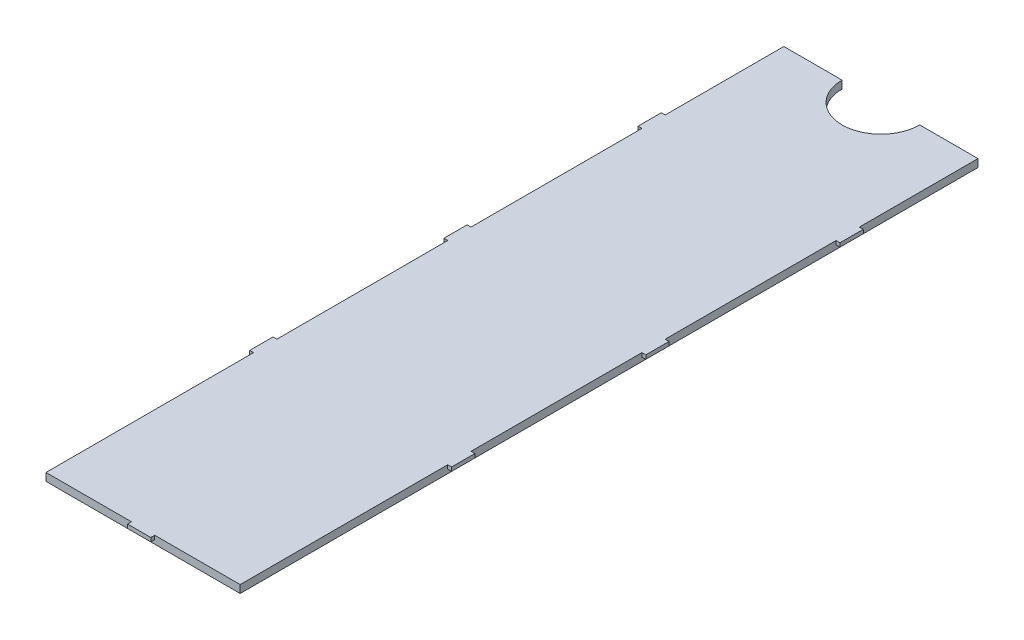
ISO-10303-21;
HEADER;
FILE_DESCRIPTION(('STEP AP214'),'2;1');
FILE_NAME('part.step','',(''),(''),'','','');
FILE_SCHEMA(('AUTOMOTIVE_DESIGN { 1 0 10303 214 1 1 1 1 }'));
ENDSEC;
DATA;
#1=APPLICATION_CONTEXT('core data for automotive mechanical design processes');
#2=APPLICATION_PROTOCOL_DEFINITION('international standard','automotive_design',2000,#1);
#3=PRODUCT_CONTEXT('',#1,'mechanical');
#4=PRODUCT('Part','Part','',(#3));
#5=PRODUCT_RELATED_PRODUCT_CATEGORY('part','',(#4));
#6=PRODUCT_DEFINITION_FORMATION('','',#4);
#7=PRODUCT_DEFINITION_CONTEXT('part definition',#1,'design');
#8=PRODUCT_DEFINITION('design','',#6,#7);
#9=PRODUCT_DEFINITION_SHAPE('','',#8);
#10=(LENGTH_UNIT() NAMED_UNIT(*) SI_UNIT(.MILLI.,.METRE.));
#11=(NAMED_UNIT(*) PLANE_ANGLE_UNIT() SI_UNIT($,.RADIAN.));
#12=(NAMED_UNIT(*) SI_UNIT($,.STERADIAN.) SOLID_ANGLE_UNIT());
#13=UNCERTAINTY_MEASURE_WITH_UNIT(LENGTH_MEASURE(1.E-05),#10,'distance_accuracy_value','');
#14=(GEOMETRIC_REPRESENTATION_CONTEXT(3) GLOBAL_UNCERTAINTY_ASSIGNED_CONTEXT((#13)) GLOBAL_UNIT_ASSIGNED_CONTEXT((#10,
#11,#12)) REPRESENTATION_CONTEXT('',''));
#15=CARTESIAN_POINT('',(0.,0.,0.));
#16=DIRECTION('',(0.,0.,1.));
#17=DIRECTION('',(1.,0.,0.));
#18=AXIS2_PLACEMENT_3D('',#15,#16,#17);
#19=CARTESIAN_POINT('',(0.,35.274050100301,1.80750317688863));
#20=DIRECTION('',(0.,0.,1.));
#21=DIRECTION('',(1.,0.,0.));
#22=AXIS2_PLACEMENT_3D('',#19,#20,#21);
#23=PLANE('',#22);
#24=DIRECTION('',(-1.,0.,0.));
#25=VECTOR('',#24,1.);
#26=CARTESIAN_POINT('',(0.,35.274050100301,1.80750317688863));
#27=LINE('',#26,#25);
#28=CARTESIAN_POINT('',(-86.6012572167533,35.274050100301,1.80750317688863));
#29=VERTEX_POINT('',#28);
#30=CARTESIAN_POINT('',(-94.1012572167536,35.274050100301,1.80750317688863));
#31=VERTEX_POINT('',#30);
#32=EDGE_CURVE('E283',#29,#31,#27,.T.);
#33=ORIENTED_EDGE('',*,*,#32,.F.);
#34=DIRECTION('',(0.,-1.,0.));
#35=VECTOR('',#34,1.);
#36=CARTESIAN_POINT('',(-86.6012572167533,35.274050100301,1.80750317688863));
#37=LINE('',#36,#35);
#38=CARTESIAN_POINT('',(-86.6012572167533,34.274050100301,1.80750317688863));
#39=VERTEX_POINT('',#38);
#40=EDGE_CURVE('E263',#29,#39,#37,.T.);
#41=ORIENTED_EDGE('',*,*,#40,.T.);
#42=DIRECTION('',(-1.,0.,0.));
#43=VECTOR('',#42,1.);
#44=CARTESIAN_POINT('',(0.,34.274050100301,1.80750317688863));
#45=LINE('',#44,#43);
#46=CARTESIAN_POINT('',(-94.1012572167536,34.274050100301,1.80750317688863));
#47=VERTEX_POINT('',#46);
#48=EDGE_CURVE('E302',#39,#47,#45,.T.);
#49=ORIENTED_EDGE('',*,*,#48,.T.);
#50=DIRECTION('',(0.,-1.,0.));
#51=VECTOR('',#50,1.);
#52=CARTESIAN_POINT('',(-94.1012572167536,35.274050100301,1.80750317688863));
#53=LINE('',#52,#51);
#54=EDGE_CURVE('E298',#31,#47,#53,.T.);
#55=ORIENTED_EDGE('',*,*,#54,.F.);
#56=EDGE_LOOP('',(#33,#41,#49,#55));
#57=FACE_BOUND('',#56,.T.);
#58=ADVANCED_FACE('F40',(#57),#23,.F.);
#59=CARTESIAN_POINT('',(-94.1012572167536,35.274050100301,0.));
#60=DIRECTION('',(1.,0.,0.));
#61=DIRECTION('',(0.,0.,-1.));
#62=AXIS2_PLACEMENT_3D('',#59,#60,#61);
#63=PLANE('',#62);
#64=DIRECTION('',(0.,0.,-1.));
#65=VECTOR('',#64,1.);
#66=CARTESIAN_POINT('',(-94.1012572167536,34.774050100301,0.));
#67=LINE('',#66,#65);
#68=CARTESIAN_POINT('',(-94.1012572167536,34.774050100301,20.0802620856482));
#69=VERTEX_POINT('',#68);
#70=CARTESIAN_POINT('',(-94.1012572167536,34.774050100301,17.0802620856482));
#71=VERTEX_POINT('',#70);
#72=EDGE_CURVE('E332',#69,#71,#67,.T.);
#73=ORIENTED_EDGE('',*,*,#72,.T.);
#74=DIRECTION('',(0.,1.,0.));
#75=VECTOR('',#74,1.);
#76=CARTESIAN_POINT('',(-94.1012572167536,35.274050100301,17.0802620856482));
#77=LINE('',#76,#75);
#78=CARTESIAN_POINT('',(-94.1012572167536,35.274050100301,17.0802620856482));
#79=VERTEX_POINT('',#78);
#80=EDGE_CURVE('E398',#71,#79,#77,.T.);
#81=ORIENTED_EDGE('',*,*,#80,.T.);
#82=DIRECTION('',(0.,0.,1.));
#83=VECTOR('',#82,1.);
#84=CARTESIAN_POINT('',(-94.1012572167536,35.274050100301,0.));
#85=LINE('',#84,#83);
#86=EDGE_CURVE('E288',#31,#79,#85,.T.);
#87=ORIENTED_EDGE('',*,*,#86,.F.);
#88=ORIENTED_EDGE('',*,*,#54,.T.);
#89=DIRECTION('',(0.,0.,1.));
#90=VECTOR('',#89,1.);
#91=CARTESIAN_POINT('',(-94.1012572167536,34.274050100301,0.));
#92=LINE('',#91,#90);
#93=CARTESIAN_POINT('',(-94.1012572167536,34.274050100301,96.8075031768886));
#94=VERTEX_POINT('',#93);
#95=EDGE_CURVE('E299',#47,#94,#92,.T.);
#96=ORIENTED_EDGE('',*,*,#95,.T.);
#97=DIRECTION('',(0.,-1.,0.));
#98=VECTOR('',#97,1.);
#99=CARTESIAN_POINT('',(-94.1012572167536,35.274050100301,96.8075031768886));
#100=LINE('',#99,#98);
#101=CARTESIAN_POINT('',(-94.1012572167536,35.274050100301,96.8075031768886));
#102=VERTEX_POINT('',#101);
#103=EDGE_CURVE('E310',#102,#94,#100,.T.);
#104=ORIENTED_EDGE('',*,*,#103,.F.);
#105=CARTESIAN_POINT('',(-94.1012572167536,35.274050100301,70.0802620856482));
#106=VERTEX_POINT('',#105);
#107=EDGE_CURVE('E309',#106,#102,#85,.T.);
#108=ORIENTED_EDGE('',*,*,#107,.F.);
#109=DIRECTION('',(0.,-1.,0.));
#110=VECTOR('',#109,1.);
#111=CARTESIAN_POINT('',(-94.1012572167536,35.274050100301,70.0802620856482));
#112=LINE('',#111,#110);
#113=CARTESIAN_POINT('',(-94.1012572167536,34.774050100301,70.0802620856482));
#114=VERTEX_POINT('',#113);
#115=EDGE_CURVE('E441',#106,#114,#112,.T.);
#116=ORIENTED_EDGE('',*,*,#115,.T.);
#117=DIRECTION('',(0.,0.,-1.));
#118=VECTOR('',#117,1.);
#119=CARTESIAN_POINT('',(-94.1012572167536,34.774050100301,0.));
#120=LINE('',#119,#118);
#121=CARTESIAN_POINT('',(-94.1012572167536,34.774050100301,67.0802620856482));
#122=VERTEX_POINT('',#121);
#123=EDGE_CURVE('E326',#114,#122,#120,.T.);
#124=ORIENTED_EDGE('',*,*,#123,.T.);
#125=DIRECTION('',(0.,1.,0.));
#126=VECTOR('',#125,1.);
#127=CARTESIAN_POINT('',(-94.1012572167536,35.274050100301,67.0802620856482));
#128=LINE('',#127,#126);
#129=CARTESIAN_POINT('',(-94.1012572167536,35.274050100301,67.0802620856482));
#130=VERTEX_POINT('',#129);
#131=EDGE_CURVE('E450',#122,#130,#128,.T.);
#132=ORIENTED_EDGE('',*,*,#131,.T.);
#133=CARTESIAN_POINT('',(-94.1012572167536,35.274050100301,45.0802620856482));
#134=VERTEX_POINT('',#133);
#135=EDGE_CURVE('E563',#134,#130,#85,.T.);
#136=ORIENTED_EDGE('',*,*,#135,.F.);
#137=DIRECTION('',(0.,-1.,0.));
#138=VECTOR('',#137,1.);
#139=CARTESIAN_POINT('',(-94.1012572167536,35.274050100301,45.0802620856482));
#140=LINE('',#139,#138);
#141=CARTESIAN_POINT('',(-94.1012572167536,34.774050100301,45.0802620856482));
#142=VERTEX_POINT('',#141);
#143=EDGE_CURVE('E415',#134,#142,#140,.T.);
#144=ORIENTED_EDGE('',*,*,#143,.T.);
#145=DIRECTION('',(0.,0.,-1.));
#146=VECTOR('',#145,1.);
#147=CARTESIAN_POINT('',(-94.1012572167536,34.774050100301,0.));
#148=LINE('',#147,#146);
#149=CARTESIAN_POINT('',(-94.1012572167536,34.774050100301,42.0802620856482));
#150=VERTEX_POINT('',#149);
#151=EDGE_CURVE('E329',#142,#150,#148,.T.);
#152=ORIENTED_EDGE('',*,*,#151,.T.);
#153=DIRECTION('',(0.,1.,0.));
#154=VECTOR('',#153,1.);
#155=CARTESIAN_POINT('',(-94.1012572167536,35.274050100301,42.0802620856482));
#156=LINE('',#155,#154);
#157=CARTESIAN_POINT('',(-94.1012572167536,35.274050100301,42.0802620856482));
#158=VERTEX_POINT('',#157);
#159=EDGE_CURVE('E424',#150,#158,#156,.T.);
#160=ORIENTED_EDGE('',*,*,#159,.T.);
#161=CARTESIAN_POINT('',(-94.1012572167536,35.274050100301,20.0802620856482));
#162=VERTEX_POINT('',#161);
#163=EDGE_CURVE('E562',#162,#158,#85,.T.);
#164=ORIENTED_EDGE('',*,*,#163,.F.);
#165=DIRECTION('',(0.,-1.,0.));
#166=VECTOR('',#165,1.);
#167=CARTESIAN_POINT('',(-94.1012572167536,35.274050100301,20.0802620856482));
#168=LINE('',#167,#166);
#169=EDGE_CURVE('E390',#162,#69,#168,.T.);
#170=ORIENTED_EDGE('',*,*,#169,.T.);
#171=EDGE_LOOP('',(#73,#81,#87,#88,#96,#104,#108,#116,#124,#132,#136,#144,#152,#160,#164,#170));
#172=FACE_BOUND('',#171,.T.);
#173=ADVANCED_FACE('F42',(#172),#63,.F.);
#174=CARTESIAN_POINT('',(0.,35.274050100301,96.8075031768886));
#175=DIRECTION('',(0.,0.,-1.));
#176=DIRECTION('',(-1.,0.,0.));
#177=AXIS2_PLACEMENT_3D('',#174,#175,#176);
#178=PLANE('',#177);
#179=DIRECTION('',(1.,0.,0.));
#180=VECTOR('',#179,1.);
#181=CARTESIAN_POINT('',(0.,35.274050100301,96.8075031768886));
#182=LINE('',#181,#180);
#183=CARTESIAN_POINT('',(-80.1012572167533,35.274050100301,96.8075031768886));
#184=VERTEX_POINT('',#183);
#185=CARTESIAN_POINT('',(-69.1012572167529,35.274050100301,96.8075031768886));
#186=VERTEX_POINT('',#185);
#187=EDGE_CURVE('E293',#184,#186,#182,.T.);
#188=ORIENTED_EDGE('',*,*,#187,.F.);
#189=DIRECTION('',(0.,-1.,0.));
#190=VECTOR('',#189,1.);
#191=CARTESIAN_POINT('',(-80.1012572167533,35.274050100301,96.8075031768886));
#192=LINE('',#191,#190);
#193=CARTESIAN_POINT('',(-80.1012572167533,34.774050100301,96.8075031768886));
#194=VERTEX_POINT('',#193);
#195=EDGE_CURVE('E475',#184,#194,#192,.T.);
#196=ORIENTED_EDGE('',*,*,#195,.T.);
#197=DIRECTION('',(-1.,0.,0.));
#198=VECTOR('',#197,1.);
#199=CARTESIAN_POINT('',(0.,34.774050100301,96.8075031768886));
#200=LINE('',#199,#198);
#201=CARTESIAN_POINT('',(-83.1012572167533,34.774050100301,96.8075031768886));
#202=VERTEX_POINT('',#201);
#203=EDGE_CURVE('E323',#194,#202,#200,.T.);
#204=ORIENTED_EDGE('',*,*,#203,.T.);
#205=DIRECTION('',(0.,1.,0.));
#206=VECTOR('',#205,1.);
#207=CARTESIAN_POINT('',(-83.1012572167533,35.274050100301,96.8075031768886));
#208=LINE('',#207,#206);
#209=CARTESIAN_POINT('',(-83.1012572167533,35.274050100301,96.8075031768886));
#210=VERTEX_POINT('',#209);
#211=EDGE_CURVE('E467',#202,#210,#208,.T.);
#212=ORIENTED_EDGE('',*,*,#211,.T.);
#213=EDGE_CURVE('E295',#102,#210,#182,.T.);
#214=ORIENTED_EDGE('',*,*,#213,.F.);
#215=ORIENTED_EDGE('',*,*,#103,.T.);
#216=DIRECTION('',(1.,0.,0.));
#217=VECTOR('',#216,1.);
#218=CARTESIAN_POINT('',(0.,34.274050100301,96.8075031768886));
#219=LINE('',#218,#217);
#220=CARTESIAN_POINT('',(-69.1012572167529,34.274050100301,96.8075031768886));
#221=VERTEX_POINT('',#220);
#222=EDGE_CURVE('E307',#94,#221,#219,.T.);
#223=ORIENTED_EDGE('',*,*,#222,.T.);
#224=DIRECTION('',(0.,-1.,0.));
#225=VECTOR('',#224,1.);
#226=CARTESIAN_POINT('',(-69.1012572167529,35.274050100301,96.8075031768886));
#227=LINE('',#226,#225);
#228=EDGE_CURVE('E314',#186,#221,#227,.T.);
#229=ORIENTED_EDGE('',*,*,#228,.F.);
#230=EDGE_LOOP('',(#188,#196,#204,#212,#214,#215,#223,#229));
#231=FACE_BOUND('',#230,.T.);
#232=ADVANCED_FACE('F602',(#231),#178,.F.);
#233=CARTESIAN_POINT('',(-69.1012572167529,35.274050100301,0.));
#234=DIRECTION('',(-1.,0.,0.));
#235=DIRECTION('',(0.,0.,1.));
#236=AXIS2_PLACEMENT_3D('',#233,#234,#235);
#237=PLANE('',#236);
#238=DIRECTION('',(0.,0.,-1.));
#239=VECTOR('',#238,1.);
#240=CARTESIAN_POINT('',(-69.1012572167529,35.274050100301,0.));
#241=LINE('',#240,#239);
#242=CARTESIAN_POINT('',(-69.1012572167529,35.274050100301,67.0802620856482));
#243=VERTEX_POINT('',#242);
#244=CARTESIAN_POINT('',(-69.1012572167529,35.274050100301,45.0802620856482));
#245=VERTEX_POINT('',#244);
#246=EDGE_CURVE('E294',#243,#245,#241,.T.);
#247=ORIENTED_EDGE('',*,*,#246,.F.);
#248=DIRECTION('',(0.,-1.,0.));
#249=VECTOR('',#248,1.);
#250=CARTESIAN_POINT('',(-69.1012572167529,35.274050100301,67.0802620856482));
#251=LINE('',#250,#249);
#252=CARTESIAN_POINT('',(-69.1012572167529,34.774050100301,67.0802620856482));
#253=VERTEX_POINT('',#252);
#254=EDGE_CURVE('E525',#243,#253,#251,.T.);
#255=ORIENTED_EDGE('',*,*,#254,.T.);
#256=DIRECTION('',(0.,0.,1.));
#257=VECTOR('',#256,1.);
#258=CARTESIAN_POINT('',(-69.1012572167529,34.774050100301,0.));
#259=LINE('',#258,#257);
#260=CARTESIAN_POINT('',(-69.1012572167529,34.774050100301,70.0802620856482));
#261=VERTEX_POINT('',#260);
#262=EDGE_CURVE('E11',#253,#261,#259,.T.);
#263=ORIENTED_EDGE('',*,*,#262,.T.);
#264=DIRECTION('',(0.,1.,0.));
#265=VECTOR('',#264,1.);
#266=CARTESIAN_POINT('',(-69.1012572167529,35.274050100301,70.0802620856482));
#267=LINE('',#266,#265);
#268=CARTESIAN_POINT('',(-69.1012572167529,35.274050100301,70.0802620856482));
#269=VERTEX_POINT('',#268);
#270=EDGE_CURVE('E528',#261,#269,#267,.T.);
#271=ORIENTED_EDGE('',*,*,#270,.T.);
#272=EDGE_CURVE('E287',#186,#269,#241,.T.);
#273=ORIENTED_EDGE('',*,*,#272,.F.);
#274=ORIENTED_EDGE('',*,*,#228,.T.);
#275=DIRECTION('',(0.,0.,-1.));
#276=VECTOR('',#275,1.);
#277=CARTESIAN_POINT('',(-69.1012572167529,34.274050100301,0.));
#278=LINE('',#277,#276);
#279=CARTESIAN_POINT('',(-69.1012572167529,34.274050100301,1.80750317688863));
#280=VERTEX_POINT('',#279);
#281=EDGE_CURVE('E305',#221,#280,#278,.T.);
#282=ORIENTED_EDGE('',*,*,#281,.T.);
#283=DIRECTION('',(0.,-1.,0.));
#284=VECTOR('',#283,1.);
#285=CARTESIAN_POINT('',(-69.1012572167529,35.274050100301,1.80750317688863));
#286=LINE('',#285,#284);
#287=CARTESIAN_POINT('',(-69.1012572167529,35.274050100301,1.80750317688863));
#288=VERTEX_POINT('',#287);
#289=EDGE_CURVE('E317',#288,#280,#286,.T.);
#290=ORIENTED_EDGE('',*,*,#289,.F.);
#291=CARTESIAN_POINT('',(-69.1012572167529,35.274050100301,17.0802620856482));
#292=VERTEX_POINT('',#291);
#293=EDGE_CURVE('E281',#292,#288,#241,.T.);
#294=ORIENTED_EDGE('',*,*,#293,.F.);
#295=DIRECTION('',(0.,-1.,0.));
#296=VECTOR('',#295,1.);
#297=CARTESIAN_POINT('',(-69.1012572167529,35.274050100301,17.0802620856482));
#298=LINE('',#297,#296);
#299=CARTESIAN_POINT('',(-69.1012572167529,34.774050100301,17.0802620856482));
#300=VERTEX_POINT('',#299);
#301=EDGE_CURVE('E303',#292,#300,#298,.T.);
#302=ORIENTED_EDGE('',*,*,#301,.T.);
#303=DIRECTION('',(0.,0.,1.));
#304=VECTOR('',#303,1.);
#305=CARTESIAN_POINT('',(-69.1012572167529,34.774050100301,0.));
#306=LINE('',#305,#304);
#307=CARTESIAN_POINT('',(-69.1012572167529,34.774050100301,20.0802620856482));
#308=VERTEX_POINT('',#307);
#309=EDGE_CURVE('E313',#300,#308,#306,.T.);
#310=ORIENTED_EDGE('',*,*,#309,.T.);
#311=DIRECTION('',(0.,1.,0.));
#312=VECTOR('',#311,1.);
#313=CARTESIAN_POINT('',(-69.1012572167529,35.274050100301,20.0802620856482));
#314=LINE('',#313,#312);
#315=CARTESIAN_POINT('',(-69.1012572167529,35.274050100301,20.0802620856482));
#316=VERTEX_POINT('',#315);
#317=EDGE_CURVE('E497',#308,#316,#314,.T.);
#318=ORIENTED_EDGE('',*,*,#317,.T.);
#319=CARTESIAN_POINT('',(-69.1012572167529,35.274050100301,42.0802620856482));
#320=VERTEX_POINT('',#319);
#321=EDGE_CURVE('E285',#320,#316,#241,.T.);
#322=ORIENTED_EDGE('',*,*,#321,.F.);
#323=DIRECTION('',(0.,-1.,0.));
#324=VECTOR('',#323,1.);
#325=CARTESIAN_POINT('',(-69.1012572167529,35.274050100301,42.0802620856482));
#326=LINE('',#325,#324);
#327=CARTESIAN_POINT('',(-69.1012572167529,34.774050100301,42.0802620856482));
#328=VERTEX_POINT('',#327);
#329=EDGE_CURVE('E343',#320,#328,#326,.T.);
#330=ORIENTED_EDGE('',*,*,#329,.T.);
#331=DIRECTION('',(0.,0.,1.));
#332=VECTOR('',#331,1.);
#333=CARTESIAN_POINT('',(-69.1012572167529,34.774050100301,0.));
#334=LINE('',#333,#332);
#335=CARTESIAN_POINT('',(-69.1012572167529,34.774050100301,45.0802620856482));
#336=VERTEX_POINT('',#335);
#337=EDGE_CURVE('E48',#328,#336,#334,.T.);
#338=ORIENTED_EDGE('',*,*,#337,.T.);
#339=DIRECTION('',(0.,1.,0.));
#340=VECTOR('',#339,1.);
#341=CARTESIAN_POINT('',(-69.1012572167529,35.274050100301,45.0802620856482));
#342=LINE('',#341,#340);
#343=EDGE_CURVE('E341',#336,#245,#342,.T.);
#344=ORIENTED_EDGE('',*,*,#343,.T.);
#345=EDGE_LOOP('',(#247,#255,#263,#271,#273,#274,#282,#290,#294,#302,#310,#318,#322,#330,#338,#344));
#346=FACE_BOUND('',#345,.T.);
#347=ADVANCED_FACE('F339',(#346),#237,.F.);
#348=CARTESIAN_POINT('',(-76.6012572167533,34.274050100301,1.80750317688863));
#349=VERTEX_POINT('',#348);
#350=EDGE_CURVE('E276',#280,#349,#45,.T.);
#351=ORIENTED_EDGE('',*,*,#350,.T.);
#352=DIRECTION('',(0.,-1.,0.));
#353=VECTOR('',#352,1.);
#354=CARTESIAN_POINT('',(-76.6012572167533,35.274050100301,1.80750317688863));
#355=LINE('',#354,#353);
#356=CARTESIAN_POINT('',(-76.6012572167533,35.274050100301,1.80750317688863));
#357=VERTEX_POINT('',#356);
#358=EDGE_CURVE('E55',#349,#357,#355,.F.);
#359=ORIENTED_EDGE('',*,*,#358,.T.);
#360=EDGE_CURVE('E274',#288,#357,#27,.T.);
#361=ORIENTED_EDGE('',*,*,#360,.F.);
#362=ORIENTED_EDGE('',*,*,#289,.T.);
#363=EDGE_LOOP('',(#351,#359,#361,#362));
#364=FACE_BOUND('',#363,.T.);
#365=ADVANCED_FACE('F272',(#364),#23,.F.);
#366=CARTESIAN_POINT('',(0.,35.274050100301,0.));
#367=DIRECTION('',(0.,-1.,0.));
#368=DIRECTION('',(0.,0.,-1.));
#369=AXIS2_PLACEMENT_3D('',#366,#367,#368);
#370=PLANE('',#369);
#371=ORIENTED_EDGE('',*,*,#360,.T.);
#372=CARTESIAN_POINT('',(-81.6012572167533,35.274050100301,1.80750317688863));
#373=DIRECTION('',(0.,-1.,0.));
#374=DIRECTION('',(0.,0.,-1.));
#375=AXIS2_PLACEMENT_3D('',#372,#373,#374);
#376=CIRCLE('',#375,5.);
#377=EDGE_CURVE('E260',#357,#29,#376,.T.);
#378=ORIENTED_EDGE('',*,*,#377,.T.);
#379=ORIENTED_EDGE('',*,*,#32,.T.);
#380=ORIENTED_EDGE('',*,*,#86,.T.);
#381=DIRECTION('',(1.,0.,0.));
#382=VECTOR('',#381,1.);
#383=CARTESIAN_POINT('',(-94.6012572167536,35.274050100301,17.0802620856482));
#384=LINE('',#383,#382);
#385=CARTESIAN_POINT('',(-94.6012572167536,35.274050100301,17.0802620856482));
#386=VERTEX_POINT('',#385);
#387=EDGE_CURVE('E386',#386,#79,#384,.T.);
#388=ORIENTED_EDGE('',*,*,#387,.F.);
#389=DIRECTION('',(0.,0.,-1.));
#390=VECTOR('',#389,1.);
#391=CARTESIAN_POINT('',(-94.6012572167536,35.274050100301,17.0802620856482));
#392=LINE('',#391,#390);
#393=CARTESIAN_POINT('',(-94.6012572167536,35.274050100301,20.0802620856482));
#394=VERTEX_POINT('',#393);
#395=EDGE_CURVE('E380',#394,#386,#392,.T.);
#396=ORIENTED_EDGE('',*,*,#395,.F.);
#397=DIRECTION('',(-1.,0.,0.));
#398=VECTOR('',#397,1.);
#399=CARTESIAN_POINT('',(-94.6012572167536,35.274050100301,20.0802620856482));
#400=LINE('',#399,#398);
#401=EDGE_CURVE('E393',#162,#394,#400,.T.);
#402=ORIENTED_EDGE('',*,*,#401,.F.);
#403=ORIENTED_EDGE('',*,*,#163,.T.);
#404=DIRECTION('',(1.,0.,0.));
#405=VECTOR('',#404,1.);
#406=CARTESIAN_POINT('',(-94.6012572167536,35.274050100301,42.0802620856482));
#407=LINE('',#406,#405);
#408=CARTESIAN_POINT('',(-94.6012572167536,35.274050100301,42.0802620856482));
#409=VERTEX_POINT('',#408);
#410=EDGE_CURVE('E411',#409,#158,#407,.T.);
#411=ORIENTED_EDGE('',*,*,#410,.F.);
#412=DIRECTION('',(0.,0.,-1.));
#413=VECTOR('',#412,1.);
#414=CARTESIAN_POINT('',(-94.6012572167536,35.274050100301,42.0802620856482));
#415=LINE('',#414,#413);
#416=CARTESIAN_POINT('',(-94.6012572167536,35.274050100301,45.0802620856482));
#417=VERTEX_POINT('',#416);
#418=EDGE_CURVE('E405',#417,#409,#415,.T.);
#419=ORIENTED_EDGE('',*,*,#418,.F.);
#420=DIRECTION('',(-1.,0.,0.));
#421=VECTOR('',#420,1.);
#422=CARTESIAN_POINT('',(-94.6012572167536,35.274050100301,45.0802620856482));
#423=LINE('',#422,#421);
#424=EDGE_CURVE('E418',#134,#417,#423,.T.);
#425=ORIENTED_EDGE('',*,*,#424,.F.);
#426=ORIENTED_EDGE('',*,*,#135,.T.);
#427=DIRECTION('',(1.,0.,0.));
#428=VECTOR('',#427,1.);
#429=CARTESIAN_POINT('',(-94.6012572167536,35.274050100301,67.0802620856482));
#430=LINE('',#429,#428);
#431=CARTESIAN_POINT('',(-94.6012572167536,35.274050100301,67.0802620856482));
#432=VERTEX_POINT('',#431);
#433=EDGE_CURVE('E437',#432,#130,#430,.T.);
#434=ORIENTED_EDGE('',*,*,#433,.F.);
#435=DIRECTION('',(0.,0.,-1.));
#436=VECTOR('',#435,1.);
#437=CARTESIAN_POINT('',(-94.6012572167536,35.274050100301,67.0802620856482));
#438=LINE('',#437,#436);
#439=CARTESIAN_POINT('',(-94.6012572167536,35.274050100301,70.0802620856482));
#440=VERTEX_POINT('',#439);
#441=EDGE_CURVE('E431',#440,#432,#438,.T.);
#442=ORIENTED_EDGE('',*,*,#441,.F.);
#443=DIRECTION('',(-1.,0.,0.));
#444=VECTOR('',#443,1.);
#445=CARTESIAN_POINT('',(-94.6012572167536,35.274050100301,70.0802620856482));
#446=LINE('',#445,#444);
#447=EDGE_CURVE('E444',#106,#440,#446,.T.);
#448=ORIENTED_EDGE('',*,*,#447,.F.);
#449=ORIENTED_EDGE('',*,*,#107,.T.);
#450=ORIENTED_EDGE('',*,*,#213,.T.);
#451=DIRECTION('',(0.,0.,-1.));
#452=VECTOR('',#451,1.);
#453=CARTESIAN_POINT('',(-83.1012572167533,35.274050100301,96.3075031768883));
#454=LINE('',#453,#452);
#455=CARTESIAN_POINT('',(-83.1012572167533,35.274050100301,97.3075031768886));
#456=VERTEX_POINT('',#455);
#457=EDGE_CURVE('E457',#456,#210,#454,.T.);
#458=ORIENTED_EDGE('',*,*,#457,.F.);
#459=DIRECTION('',(-1.,0.,0.));
#460=VECTOR('',#459,1.);
#461=CARTESIAN_POINT('',(-80.1012572167533,35.274050100301,97.3075031768886));
#462=LINE('',#461,#460);
#463=CARTESIAN_POINT('',(-80.1012572167533,35.274050100301,97.3075031768886));
#464=VERTEX_POINT('',#463);
#465=EDGE_CURVE('E469',#464,#456,#462,.T.);
#466=ORIENTED_EDGE('',*,*,#465,.F.);
#467=DIRECTION('',(0.,0.,1.));
#468=VECTOR('',#467,1.);
#469=CARTESIAN_POINT('',(-80.1012572167533,35.274050100301,96.3075031768883));
#470=LINE('',#469,#468);
#471=EDGE_CURVE('E462',#184,#464,#470,.T.);
#472=ORIENTED_EDGE('',*,*,#471,.F.);
#473=ORIENTED_EDGE('',*,*,#187,.T.);
#474=ORIENTED_EDGE('',*,*,#272,.T.);
#475=DIRECTION('',(-1.,0.,0.));
#476=VECTOR('',#475,1.);
#477=CARTESIAN_POINT('',(-68.6012572167529,35.274050100301,70.0802620856482));
#478=LINE('',#477,#476);
#479=CARTESIAN_POINT('',(-68.6012572167529,35.274050100301,70.0802620856482));
#480=VERTEX_POINT('',#479);
#481=EDGE_CURVE('E536',#480,#269,#478,.T.);
#482=ORIENTED_EDGE('',*,*,#481,.F.);
#483=DIRECTION('',(0.,0.,1.));
#484=VECTOR('',#483,1.);
#485=CARTESIAN_POINT('',(-68.6012572167529,35.274050100301,67.0802620856482));
#486=LINE('',#485,#484);
#487=CARTESIAN_POINT('',(-68.6012572167529,35.274050100301,67.0802620856482));
#488=VERTEX_POINT('',#487);
#489=EDGE_CURVE('E532',#488,#480,#486,.T.);
#490=ORIENTED_EDGE('',*,*,#489,.F.);
#491=DIRECTION('',(1.,0.,0.));
#492=VECTOR('',#491,1.);
#493=CARTESIAN_POINT('',(-68.6012572167529,35.274050100301,67.0802620856482));
#494=LINE('',#493,#492);
#495=EDGE_CURVE('E520',#243,#488,#494,.T.);
#496=ORIENTED_EDGE('',*,*,#495,.F.);
#497=ORIENTED_EDGE('',*,*,#246,.T.);
#498=DIRECTION('',(-1.,0.,0.));
#499=VECTOR('',#498,1.);
#500=CARTESIAN_POINT('',(-68.6012572167529,35.274050100301,45.0802620856482));
#501=LINE('',#500,#499);
#502=CARTESIAN_POINT('',(-68.6012572167529,35.274050100301,45.0802620856482));
#503=VERTEX_POINT('',#502);
#504=EDGE_CURVE('E363',#503,#245,#501,.T.);
#505=ORIENTED_EDGE('',*,*,#504,.F.);
#506=DIRECTION('',(0.,0.,1.));
#507=VECTOR('',#506,1.);
#508=CARTESIAN_POINT('',(-68.6012572167529,35.274050100301,42.0802620856482));
#509=LINE('',#508,#507);
#510=CARTESIAN_POINT('',(-68.6012572167529,35.274050100301,42.0802620856482));
#511=VERTEX_POINT('',#510);
#512=EDGE_CURVE('E358',#511,#503,#509,.T.);
#513=ORIENTED_EDGE('',*,*,#512,.F.);
#514=DIRECTION('',(1.,0.,0.));
#515=VECTOR('',#514,1.);
#516=CARTESIAN_POINT('',(-68.6012572167529,35.274050100301,42.0802620856482));
#517=LINE('',#516,#515);
#518=EDGE_CURVE('E369',#320,#511,#517,.T.);
#519=ORIENTED_EDGE('',*,*,#518,.F.);
#520=ORIENTED_EDGE('',*,*,#321,.T.);
#521=DIRECTION('',(-1.,0.,0.));
#522=VECTOR('',#521,1.);
#523=CARTESIAN_POINT('',(-68.6012572167529,35.274050100301,20.0802620856482));
#524=LINE('',#523,#522);
#525=CARTESIAN_POINT('',(-68.6012572167529,35.274050100301,20.0802620856482));
#526=VERTEX_POINT('',#525);
#527=EDGE_CURVE('E482',#526,#316,#524,.T.);
#528=ORIENTED_EDGE('',*,*,#527,.F.);
#529=DIRECTION('',(0.,0.,1.));
#530=VECTOR('',#529,1.);
#531=CARTESIAN_POINT('',(-68.6012572167529,35.274050100301,17.0802620856482));
#532=LINE('',#531,#530);
#533=CARTESIAN_POINT('',(-68.6012572167529,35.274050100301,17.0802620856482));
#534=VERTEX_POINT('',#533);
#535=EDGE_CURVE('E479',#534,#526,#532,.T.);
#536=ORIENTED_EDGE('',*,*,#535,.F.);
#537=DIRECTION('',(1.,0.,0.));
#538=VECTOR('',#537,1.);
#539=CARTESIAN_POINT('',(-68.6012572167529,35.274050100301,17.0802620856482));
#540=LINE('',#539,#538);
#541=EDGE_CURVE('E486',#292,#534,#540,.T.);
#542=ORIENTED_EDGE('',*,*,#541,.F.);
#543=ORIENTED_EDGE('',*,*,#293,.T.);
#544=EDGE_LOOP('',(#371,#378,#379,#380,#388,#396,#402,#403,#411,#419,#425,#426,#434,#442,#448,
#449,#450,#458,#466,#472,#473,#474,#482,#490,#496,#497,#505,#513,#519,#520,#528,#536,#542,#543));
#545=FACE_BOUND('',#544,.T.);
#546=ADVANCED_FACE('F278',(#545),#370,.F.);
#547=CARTESIAN_POINT('',(0.,34.274050100301,0.));
#548=DIRECTION('',(0.,-1.,0.));
#549=DIRECTION('',(0.,0.,-1.));
#550=AXIS2_PLACEMENT_3D('',#547,#548,#549);
#551=PLANE('',#550);
#552=CARTESIAN_POINT('',(-81.6012572167533,34.274050100301,1.80750317688863));
#553=DIRECTION('',(0.,-1.,0.));
#554=DIRECTION('',(0.,0.,-1.));
#555=AXIS2_PLACEMENT_3D('',#552,#553,#554);
#556=CIRCLE('',#555,5.);
#557=EDGE_CURVE('E267',#349,#39,#556,.T.);
#558=ORIENTED_EDGE('',*,*,#557,.F.);
#559=ORIENTED_EDGE('',*,*,#350,.F.);
#560=ORIENTED_EDGE('',*,*,#281,.F.);
#561=ORIENTED_EDGE('',*,*,#222,.F.);
#562=ORIENTED_EDGE('',*,*,#95,.F.);
#563=ORIENTED_EDGE('',*,*,#48,.F.);
#564=EDGE_LOOP('',(#558,#559,#560,#561,#562,#563));
#565=FACE_BOUND('',#564,.T.);
#566=ADVANCED_FACE('F553',(#565),#551,.T.);
#567=CARTESIAN_POINT('',(0.,34.774050100301,0.));
#568=DIRECTION('',(0.,-1.,0.));
#569=DIRECTION('',(0.,0.,-1.));
#570=AXIS2_PLACEMENT_3D('',#567,#568,#569);
#571=PLANE('',#570);
#572=ORIENTED_EDGE('',*,*,#309,.F.);
#573=DIRECTION('',(1.,0.,0.));
#574=VECTOR('',#573,1.);
#575=CARTESIAN_POINT('',(-68.6012572167529,34.774050100301,17.0802620856482));
#576=LINE('',#575,#574);
#577=CARTESIAN_POINT('',(-68.6012572167529,34.774050100301,17.0802620856482));
#578=VERTEX_POINT('',#577);
#579=EDGE_CURVE('E483',#300,#578,#576,.T.);
#580=ORIENTED_EDGE('',*,*,#579,.T.);
#581=DIRECTION('',(0.,0.,1.));
#582=VECTOR('',#581,1.);
#583=CARTESIAN_POINT('',(-68.6012572167529,34.774050100301,17.0802620856482));
#584=LINE('',#583,#582);
#585=CARTESIAN_POINT('',(-68.6012572167529,34.774050100301,20.0802620856482));
#586=VERTEX_POINT('',#585);
#587=EDGE_CURVE('E478',#578,#586,#584,.T.);
#588=ORIENTED_EDGE('',*,*,#587,.T.);
#589=DIRECTION('',(-1.,0.,0.));
#590=VECTOR('',#589,1.);
#591=CARTESIAN_POINT('',(-68.6012572167529,34.774050100301,20.0802620856482));
#592=LINE('',#591,#590);
#593=EDGE_CURVE('E491',#586,#308,#592,.T.);
#594=ORIENTED_EDGE('',*,*,#593,.T.);
#595=EDGE_LOOP('',(#572,#580,#588,#594));
#596=FACE_BOUND('',#595,.T.);
#597=ADVANCED_FACE('F512',(#596),#571,.T.);
#598=CARTESIAN_POINT('',(-68.6012572167529,35.274050100301,17.0802620856482));
#599=DIRECTION('',(0.,0.,-1.));
#600=DIRECTION('',(-1.,0.,0.));
#601=AXIS2_PLACEMENT_3D('',#598,#599,#600);
#602=PLANE('',#601);
#603=ORIENTED_EDGE('',*,*,#301,.F.);
#604=ORIENTED_EDGE('',*,*,#541,.T.);
#605=DIRECTION('',(0.,-1.,0.));
#606=VECTOR('',#605,1.);
#607=CARTESIAN_POINT('',(-68.6012572167529,35.274050100301,17.0802620856482));
#608=LINE('',#607,#606);
#609=EDGE_CURVE('E494',#534,#578,#608,.T.);
#610=ORIENTED_EDGE('',*,*,#609,.T.);
#611=ORIENTED_EDGE('',*,*,#579,.F.);
#612=EDGE_LOOP('',(#603,#604,#610,#611));
#613=FACE_BOUND('',#612,.T.);
#614=ADVANCED_FACE('F503',(#613),#602,.T.);
#615=CARTESIAN_POINT('',(-68.6012572167529,35.274050100301,20.0802620856482));
#616=DIRECTION('',(0.,0.,1.));
#617=DIRECTION('',(1.,0.,0.));
#618=AXIS2_PLACEMENT_3D('',#615,#616,#617);
#619=PLANE('',#618);
#620=ORIENTED_EDGE('',*,*,#317,.F.);
#621=ORIENTED_EDGE('',*,*,#593,.F.);
#622=DIRECTION('',(0.,-1.,0.));
#623=VECTOR('',#622,1.);
#624=CARTESIAN_POINT('',(-68.6012572167529,35.274050100301,20.0802620856482));
#625=LINE('',#624,#623);
#626=EDGE_CURVE('E488',#526,#586,#625,.T.);
#627=ORIENTED_EDGE('',*,*,#626,.F.);
#628=ORIENTED_EDGE('',*,*,#527,.T.);
#629=EDGE_LOOP('',(#620,#621,#627,#628));
#630=FACE_BOUND('',#629,.T.);
#631=ADVANCED_FACE('F515',(#630),#619,.T.);
#632=CARTESIAN_POINT('',(-68.6012572167529,35.274050100301,17.0802620856482));
#633=DIRECTION('',(1.,0.,0.));
#634=DIRECTION('',(0.,0.,-1.));
#635=AXIS2_PLACEMENT_3D('',#632,#633,#634);
#636=PLANE('',#635);
#637=ORIENTED_EDGE('',*,*,#587,.F.);
#638=ORIENTED_EDGE('',*,*,#609,.F.);
#639=ORIENTED_EDGE('',*,*,#535,.T.);
#640=ORIENTED_EDGE('',*,*,#626,.T.);
#641=EDGE_LOOP('',(#637,#638,#639,#640));
#642=FACE_BOUND('',#641,.T.);
#643=ADVANCED_FACE('F509',(#642),#636,.T.);
#644=CARTESIAN_POINT('',(0.,34.774050100301,0.));
#645=DIRECTION('',(0.,-1.,0.));
#646=DIRECTION('',(0.,0.,-1.));
#647=AXIS2_PLACEMENT_3D('',#644,#645,#646);
#648=PLANE('',#647);
#649=ORIENTED_EDGE('',*,*,#203,.F.);
#650=DIRECTION('',(0.,0.,1.));
#651=VECTOR('',#650,1.);
#652=CARTESIAN_POINT('',(-80.1012572167533,34.774050100301,96.3075031768883));
#653=LINE('',#652,#651);
#654=CARTESIAN_POINT('',(-80.1012572167533,34.774050100301,97.3075031768886));
#655=VERTEX_POINT('',#654);
#656=EDGE_CURVE('E465',#194,#655,#653,.T.);
#657=ORIENTED_EDGE('',*,*,#656,.T.);
#658=DIRECTION('',(-1.,0.,0.));
#659=VECTOR('',#658,1.);
#660=CARTESIAN_POINT('',(-80.1012572167533,34.774050100301,97.3075031768886));
#661=LINE('',#660,#659);
#662=CARTESIAN_POINT('',(-83.1012572167533,34.774050100301,97.3075031768886));
#663=VERTEX_POINT('',#662);
#664=EDGE_CURVE('E461',#655,#663,#661,.T.);
#665=ORIENTED_EDGE('',*,*,#664,.T.);
#666=DIRECTION('',(0.,0.,-1.));
#667=VECTOR('',#666,1.);
#668=CARTESIAN_POINT('',(-83.1012572167533,34.774050100301,96.3075031768883));
#669=LINE('',#668,#667);
#670=EDGE_CURVE('E459',#663,#202,#669,.T.);
#671=ORIENTED_EDGE('',*,*,#670,.T.);
#672=EDGE_LOOP('',(#649,#657,#665,#671));
#673=FACE_BOUND('',#672,.T.);
#674=ADVANCED_FACE('F620',(#673),#648,.T.);
#675=CARTESIAN_POINT('',(-80.1012572167533,35.274050100301,96.3075031768883));
#676=DIRECTION('',(1.,0.,0.));
#677=DIRECTION('',(0.,0.,-1.));
#678=AXIS2_PLACEMENT_3D('',#675,#676,#677);
#679=PLANE('',#678);
#680=ORIENTED_EDGE('',*,*,#195,.F.);
#681=ORIENTED_EDGE('',*,*,#471,.T.);
#682=DIRECTION('',(0.,-1.,0.));
#683=VECTOR('',#682,1.);
#684=CARTESIAN_POINT('',(-80.1012572167533,35.274050100301,97.3075031768886));
#685=LINE('',#684,#683);
#686=EDGE_CURVE('E454',#464,#655,#685,.T.);
#687=ORIENTED_EDGE('',*,*,#686,.T.);
#688=ORIENTED_EDGE('',*,*,#656,.F.);
#689=EDGE_LOOP('',(#680,#681,#687,#688));
#690=FACE_BOUND('',#689,.T.);
#691=ADVANCED_FACE('F628',(#690),#679,.T.);
#692=CARTESIAN_POINT('',(-83.1012572167533,35.274050100301,96.3075031768883));
#693=DIRECTION('',(-1.,0.,0.));
#694=DIRECTION('',(0.,0.,1.));
#695=AXIS2_PLACEMENT_3D('',#692,#693,#694);
#696=PLANE('',#695);
#697=ORIENTED_EDGE('',*,*,#211,.F.);
#698=ORIENTED_EDGE('',*,*,#670,.F.);
#699=DIRECTION('',(0.,-1.,0.));
#700=VECTOR('',#699,1.);
#701=CARTESIAN_POINT('',(-83.1012572167533,35.274050100301,97.3075031768886));
#702=LINE('',#701,#700);
#703=EDGE_CURVE('E453',#456,#663,#702,.T.);
#704=ORIENTED_EDGE('',*,*,#703,.F.);
#705=ORIENTED_EDGE('',*,*,#457,.T.);
#706=EDGE_LOOP('',(#697,#698,#704,#705));
#707=FACE_BOUND('',#706,.T.);
#708=ADVANCED_FACE('F630',(#707),#696,.T.);
#709=CARTESIAN_POINT('',(-80.1012572167533,35.274050100301,97.3075031768886));
#710=DIRECTION('',(0.,0.,1.));
#711=DIRECTION('',(1.,0.,0.));
#712=AXIS2_PLACEMENT_3D('',#709,#710,#711);
#713=PLANE('',#712);
#714=ORIENTED_EDGE('',*,*,#664,.F.);
#715=ORIENTED_EDGE('',*,*,#686,.F.);
#716=ORIENTED_EDGE('',*,*,#465,.T.);
#717=ORIENTED_EDGE('',*,*,#703,.T.);
#718=EDGE_LOOP('',(#714,#715,#716,#717));
#719=FACE_BOUND('',#718,.T.);
#720=ADVANCED_FACE('F633',(#719),#713,.T.);
#721=CARTESIAN_POINT('',(0.,34.774050100301,0.));
#722=DIRECTION('',(0.,-1.,0.));
#723=DIRECTION('',(0.,0.,-1.));
#724=AXIS2_PLACEMENT_3D('',#721,#722,#723);
#725=PLANE('',#724);
#726=ORIENTED_EDGE('',*,*,#123,.F.);
#727=DIRECTION('',(-1.,0.,0.));
#728=VECTOR('',#727,1.);
#729=CARTESIAN_POINT('',(-94.6012572167536,34.774050100301,70.0802620856482));
#730=LINE('',#729,#728);
#731=CARTESIAN_POINT('',(-94.6012572167536,34.774050100301,70.0802620856482));
#732=VERTEX_POINT('',#731);
#733=EDGE_CURVE('E436',#114,#732,#730,.T.);
#734=ORIENTED_EDGE('',*,*,#733,.T.);
#735=DIRECTION('',(0.,0.,-1.));
#736=VECTOR('',#735,1.);
#737=CARTESIAN_POINT('',(-94.6012572167536,34.774050100301,67.0802620856482));
#738=LINE('',#737,#736);
#739=CARTESIAN_POINT('',(-94.6012572167536,34.774050100301,67.0802620856482));
#740=VERTEX_POINT('',#739);
#741=EDGE_CURVE('E433',#732,#740,#738,.T.);
#742=ORIENTED_EDGE('',*,*,#741,.T.);
#743=DIRECTION('',(1.,0.,0.));
#744=VECTOR('',#743,1.);
#745=CARTESIAN_POINT('',(-94.6012572167536,34.774050100301,67.0802620856482));
#746=LINE('',#745,#744);
#747=EDGE_CURVE('E439',#740,#122,#746,.T.);
#748=ORIENTED_EDGE('',*,*,#747,.T.);
#749=EDGE_LOOP('',(#726,#734,#742,#748));
#750=FACE_BOUND('',#749,.T.);
#751=ADVANCED_FACE('F577',(#750),#725,.T.);
#752=CARTESIAN_POINT('',(-94.6012572167536,35.274050100301,67.0802620856482));
#753=DIRECTION('',(0.,0.,-1.));
#754=DIRECTION('',(-1.,0.,0.));
#755=AXIS2_PLACEMENT_3D('',#752,#753,#754);
#756=PLANE('',#755);
#757=ORIENTED_EDGE('',*,*,#131,.F.);
#758=ORIENTED_EDGE('',*,*,#747,.F.);
#759=DIRECTION('',(0.,-1.,0.));
#760=VECTOR('',#759,1.);
#761=CARTESIAN_POINT('',(-94.6012572167536,35.274050100301,67.0802620856482));
#762=LINE('',#761,#760);
#763=EDGE_CURVE('E427',#432,#740,#762,.T.);
#764=ORIENTED_EDGE('',*,*,#763,.F.);
#765=ORIENTED_EDGE('',*,*,#433,.T.);
#766=EDGE_LOOP('',(#757,#758,#764,#765));
#767=FACE_BOUND('',#766,.T.);
#768=ADVANCED_FACE('F573',(#767),#756,.T.);
#769=CARTESIAN_POINT('',(-94.6012572167536,35.274050100301,70.0802620856482));
#770=DIRECTION('',(0.,0.,1.));
#771=DIRECTION('',(1.,0.,0.));
#772=AXIS2_PLACEMENT_3D('',#769,#770,#771);
#773=PLANE('',#772);
#774=ORIENTED_EDGE('',*,*,#115,.F.);
#775=ORIENTED_EDGE('',*,*,#447,.T.);
#776=DIRECTION('',(0.,-1.,0.));
#777=VECTOR('',#776,1.);
#778=CARTESIAN_POINT('',(-94.6012572167536,35.274050100301,70.0802620856482));
#779=LINE('',#778,#777);
#780=EDGE_CURVE('E428',#440,#732,#779,.T.);
#781=ORIENTED_EDGE('',*,*,#780,.T.);
#782=ORIENTED_EDGE('',*,*,#733,.F.);
#783=EDGE_LOOP('',(#774,#775,#781,#782));
#784=FACE_BOUND('',#783,.T.);
#785=ADVANCED_FACE('F579',(#784),#773,.T.);
#786=CARTESIAN_POINT('',(-94.6012572167536,35.274050100301,67.0802620856482));
#787=DIRECTION('',(-1.,0.,0.));
#788=DIRECTION('',(0.,0.,1.));
#789=AXIS2_PLACEMENT_3D('',#786,#787,#788);
#790=PLANE('',#789);
#791=ORIENTED_EDGE('',*,*,#741,.F.);
#792=ORIENTED_EDGE('',*,*,#780,.F.);
#793=ORIENTED_EDGE('',*,*,#441,.T.);
#794=ORIENTED_EDGE('',*,*,#763,.T.);
#795=EDGE_LOOP('',(#791,#792,#793,#794));
#796=FACE_BOUND('',#795,.T.);
#797=ADVANCED_FACE('F583',(#796),#790,.T.);
#798=CARTESIAN_POINT('',(0.,34.774050100301,0.));
#799=DIRECTION('',(0.,-1.,0.));
#800=DIRECTION('',(0.,0.,-1.));
#801=AXIS2_PLACEMENT_3D('',#798,#799,#800);
#802=PLANE('',#801);
#803=ORIENTED_EDGE('',*,*,#151,.F.);
#804=DIRECTION('',(-1.,0.,0.));
#805=VECTOR('',#804,1.);
#806=CARTESIAN_POINT('',(-94.6012572167536,34.774050100301,45.0802620856482));
#807=LINE('',#806,#805);
#808=CARTESIAN_POINT('',(-94.6012572167536,34.774050100301,45.0802620856482));
#809=VERTEX_POINT('',#808);
#810=EDGE_CURVE('E410',#142,#809,#807,.T.);
#811=ORIENTED_EDGE('',*,*,#810,.T.);
#812=DIRECTION('',(0.,0.,-1.));
#813=VECTOR('',#812,1.);
#814=CARTESIAN_POINT('',(-94.6012572167536,34.774050100301,42.0802620856482));
#815=LINE('',#814,#813);
#816=CARTESIAN_POINT('',(-94.6012572167536,34.774050100301,42.0802620856482));
#817=VERTEX_POINT('',#816);
#818=EDGE_CURVE('E407',#809,#817,#815,.T.);
#819=ORIENTED_EDGE('',*,*,#818,.T.);
#820=DIRECTION('',(1.,0.,0.));
#821=VECTOR('',#820,1.);
#822=CARTESIAN_POINT('',(-94.6012572167536,34.774050100301,42.0802620856482));
#823=LINE('',#822,#821);
#824=EDGE_CURVE('E413',#817,#150,#823,.T.);
#825=ORIENTED_EDGE('',*,*,#824,.T.);
#826=EDGE_LOOP('',(#803,#811,#819,#825));
#827=FACE_BOUND('',#826,.T.);
#828=ADVANCED_FACE('F585',(#827),#802,.T.);
#829=CARTESIAN_POINT('',(-94.6012572167536,35.274050100301,42.0802620856482));
#830=DIRECTION('',(0.,0.,-1.));
#831=DIRECTION('',(-1.,0.,0.));
#832=AXIS2_PLACEMENT_3D('',#829,#830,#831);
#833=PLANE('',#832);
#834=ORIENTED_EDGE('',*,*,#159,.F.);
#835=ORIENTED_EDGE('',*,*,#824,.F.);
#836=DIRECTION('',(0.,-1.,0.));
#837=VECTOR('',#836,1.);
#838=CARTESIAN_POINT('',(-94.6012572167536,35.274050100301,42.0802620856482));
#839=LINE('',#838,#837);
#840=EDGE_CURVE('E401',#409,#817,#839,.T.);
#841=ORIENTED_EDGE('',*,*,#840,.F.);
#842=ORIENTED_EDGE('',*,*,#410,.T.);
#843=EDGE_LOOP('',(#834,#835,#841,#842));
#844=FACE_BOUND('',#843,.T.);
#845=ADVANCED_FACE('F591',(#844),#833,.T.);
#846=CARTESIAN_POINT('',(-94.6012572167536,35.274050100301,45.0802620856482));
#847=DIRECTION('',(0.,0.,1.));
#848=DIRECTION('',(1.,0.,0.));
#849=AXIS2_PLACEMENT_3D('',#846,#847,#848);
#850=PLANE('',#849);
#851=ORIENTED_EDGE('',*,*,#143,.F.);
#852=ORIENTED_EDGE('',*,*,#424,.T.);
#853=DIRECTION('',(0.,-1.,0.));
#854=VECTOR('',#853,1.);
#855=CARTESIAN_POINT('',(-94.6012572167536,35.274050100301,45.0802620856482));
#856=LINE('',#855,#854);
#857=EDGE_CURVE('E402',#417,#809,#856,.T.);
#858=ORIENTED_EDGE('',*,*,#857,.T.);
#859=ORIENTED_EDGE('',*,*,#810,.F.);
#860=EDGE_LOOP('',(#851,#852,#858,#859));
#861=FACE_BOUND('',#860,.T.);
#862=ADVANCED_FACE('F652',(#861),#850,.T.);
#863=CARTESIAN_POINT('',(-94.6012572167536,35.274050100301,42.0802620856482));
#864=DIRECTION('',(-1.,0.,0.));
#865=DIRECTION('',(0.,0.,1.));
#866=AXIS2_PLACEMENT_3D('',#863,#864,#865);
#867=PLANE('',#866);
#868=ORIENTED_EDGE('',*,*,#818,.F.);
#869=ORIENTED_EDGE('',*,*,#857,.F.);
#870=ORIENTED_EDGE('',*,*,#418,.T.);
#871=ORIENTED_EDGE('',*,*,#840,.T.);
#872=EDGE_LOOP('',(#868,#869,#870,#871));
#873=FACE_BOUND('',#872,.T.);
#874=ADVANCED_FACE('F648',(#873),#867,.T.);
#875=CARTESIAN_POINT('',(0.,34.774050100301,0.));
#876=DIRECTION('',(0.,-1.,0.));
#877=DIRECTION('',(0.,0.,-1.));
#878=AXIS2_PLACEMENT_3D('',#875,#876,#877);
#879=PLANE('',#878);
#880=ORIENTED_EDGE('',*,*,#72,.F.);
#881=DIRECTION('',(-1.,0.,0.));
#882=VECTOR('',#881,1.);
#883=CARTESIAN_POINT('',(-94.6012572167536,34.774050100301,20.0802620856482));
#884=LINE('',#883,#882);
#885=CARTESIAN_POINT('',(-94.6012572167536,34.774050100301,20.0802620856482));
#886=VERTEX_POINT('',#885);
#887=EDGE_CURVE('E385',#69,#886,#884,.T.);
#888=ORIENTED_EDGE('',*,*,#887,.T.);
#889=DIRECTION('',(0.,0.,-1.));
#890=VECTOR('',#889,1.);
#891=CARTESIAN_POINT('',(-94.6012572167536,34.774050100301,17.0802620856482));
#892=LINE('',#891,#890);
#893=CARTESIAN_POINT('',(-94.6012572167536,34.774050100301,17.0802620856482));
#894=VERTEX_POINT('',#893);
#895=EDGE_CURVE('E382',#886,#894,#892,.T.);
#896=ORIENTED_EDGE('',*,*,#895,.T.);
#897=DIRECTION('',(1.,0.,0.));
#898=VECTOR('',#897,1.);
#899=CARTESIAN_POINT('',(-94.6012572167536,34.774050100301,17.0802620856482));
#900=LINE('',#899,#898);
#901=EDGE_CURVE('E388',#894,#71,#900,.T.);
#902=ORIENTED_EDGE('',*,*,#901,.T.);
#903=EDGE_LOOP('',(#880,#888,#896,#902));
#904=FACE_BOUND('',#903,.T.);
#905=ADVANCED_FACE('F651',(#904),#879,.T.);
#906=CARTESIAN_POINT('',(-94.6012572167536,35.274050100301,17.0802620856482));
#907=DIRECTION('',(0.,0.,-1.));
#908=DIRECTION('',(-1.,0.,0.));
#909=AXIS2_PLACEMENT_3D('',#906,#907,#908);
#910=PLANE('',#909);
#911=ORIENTED_EDGE('',*,*,#80,.F.);
#912=ORIENTED_EDGE('',*,*,#901,.F.);
#913=DIRECTION('',(0.,-1.,0.));
#914=VECTOR('',#913,1.);
#915=CARTESIAN_POINT('',(-94.6012572167536,35.274050100301,17.0802620856482));
#916=LINE('',#915,#914);
#917=EDGE_CURVE('E376',#386,#894,#916,.T.);
#918=ORIENTED_EDGE('',*,*,#917,.F.);
#919=ORIENTED_EDGE('',*,*,#387,.T.);
#920=EDGE_LOOP('',(#911,#912,#918,#919));
#921=FACE_BOUND('',#920,.T.);
#922=ADVANCED_FACE('F662',(#921),#910,.T.);
#923=CARTESIAN_POINT('',(-94.6012572167536,35.274050100301,20.0802620856482));
#924=DIRECTION('',(0.,0.,1.));
#925=DIRECTION('',(1.,0.,0.));
#926=AXIS2_PLACEMENT_3D('',#923,#924,#925);
#927=PLANE('',#926);
#928=ORIENTED_EDGE('',*,*,#169,.F.);
#929=ORIENTED_EDGE('',*,*,#401,.T.);
#930=DIRECTION('',(0.,-1.,0.));
#931=VECTOR('',#930,1.);
#932=CARTESIAN_POINT('',(-94.6012572167536,35.274050100301,20.0802620856482));
#933=LINE('',#932,#931);
#934=EDGE_CURVE('E377',#394,#886,#933,.T.);
#935=ORIENTED_EDGE('',*,*,#934,.T.);
#936=ORIENTED_EDGE('',*,*,#887,.F.);
#937=EDGE_LOOP('',(#928,#929,#935,#936));
#938=FACE_BOUND('',#937,.T.);
#939=ADVANCED_FACE('F667',(#938),#927,.T.);
#940=CARTESIAN_POINT('',(-94.6012572167536,35.274050100301,17.0802620856482));
#941=DIRECTION('',(-1.,0.,0.));
#942=DIRECTION('',(0.,0.,1.));
#943=AXIS2_PLACEMENT_3D('',#940,#941,#942);
#944=PLANE('',#943);
#945=ORIENTED_EDGE('',*,*,#895,.F.);
#946=ORIENTED_EDGE('',*,*,#934,.F.);
#947=ORIENTED_EDGE('',*,*,#395,.T.);
#948=ORIENTED_EDGE('',*,*,#917,.T.);
#949=EDGE_LOOP('',(#945,#946,#947,#948));
#950=FACE_BOUND('',#949,.T.);
#951=ADVANCED_FACE('F664',(#950),#944,.T.);
#952=CARTESIAN_POINT('',(0.,34.774050100301,0.));
#953=DIRECTION('',(0.,-1.,0.));
#954=DIRECTION('',(0.,0.,-1.));
#955=AXIS2_PLACEMENT_3D('',#952,#953,#954);
#956=PLANE('',#955);
#957=ORIENTED_EDGE('',*,*,#337,.F.);
#958=DIRECTION('',(1.,0.,0.));
#959=VECTOR('',#958,1.);
#960=CARTESIAN_POINT('',(-68.6012572167529,34.774050100301,42.0802620856482));
#961=LINE('',#960,#959);
#962=CARTESIAN_POINT('',(-68.6012572167529,34.774050100301,42.0802620856482));
#963=VERTEX_POINT('',#962);
#964=EDGE_CURVE('E348',#328,#963,#961,.T.);
#965=ORIENTED_EDGE('',*,*,#964,.T.);
#966=DIRECTION('',(0.,0.,1.));
#967=VECTOR('',#966,1.);
#968=CARTESIAN_POINT('',(-68.6012572167529,34.774050100301,42.0802620856482));
#969=LINE('',#968,#967);
#970=CARTESIAN_POINT('',(-68.6012572167529,34.774050100301,45.0802620856482));
#971=VERTEX_POINT('',#970);
#972=EDGE_CURVE('E360',#963,#971,#969,.T.);
#973=ORIENTED_EDGE('',*,*,#972,.T.);
#974=DIRECTION('',(-1.,0.,0.));
#975=VECTOR('',#974,1.);
#976=CARTESIAN_POINT('',(-68.6012572167529,34.774050100301,45.0802620856482));
#977=LINE('',#976,#975);
#978=EDGE_CURVE('E351',#971,#336,#977,.T.);
#979=ORIENTED_EDGE('',*,*,#978,.T.);
#980=EDGE_LOOP('',(#957,#965,#973,#979));
#981=FACE_BOUND('',#980,.T.);
#982=ADVANCED_FACE('F346',(#981),#956,.T.);
#983=CARTESIAN_POINT('',(-68.6012572167529,35.274050100301,42.0802620856482));
#984=DIRECTION('',(0.,0.,-1.));
#985=DIRECTION('',(-1.,0.,0.));
#986=AXIS2_PLACEMENT_3D('',#983,#984,#985);
#987=PLANE('',#986);
#988=ORIENTED_EDGE('',*,*,#329,.F.);
#989=ORIENTED_EDGE('',*,*,#518,.T.);
#990=DIRECTION('',(0.,-1.,0.));
#991=VECTOR('',#990,1.);
#992=CARTESIAN_POINT('',(-68.6012572167529,35.274050100301,42.0802620856482));
#993=LINE('',#992,#991);
#994=EDGE_CURVE('E356',#511,#963,#993,.T.);
#995=ORIENTED_EDGE('',*,*,#994,.T.);
#996=ORIENTED_EDGE('',*,*,#964,.F.);
#997=EDGE_LOOP('',(#988,#989,#995,#996));
#998=FACE_BOUND('',#997,.T.);
#999=ADVANCED_FACE('F353',(#998),#987,.T.);
#1000=CARTESIAN_POINT('',(-68.6012572167529,35.274050100301,45.0802620856482));
#1001=DIRECTION('',(0.,0.,1.));
#1002=DIRECTION('',(1.,0.,0.));
#1003=AXIS2_PLACEMENT_3D('',#1000,#1001,#1002);
#1004=PLANE('',#1003);
#1005=ORIENTED_EDGE('',*,*,#343,.F.);
#1006=ORIENTED_EDGE('',*,*,#978,.F.);
#1007=DIRECTION('',(0.,-1.,0.));
#1008=VECTOR('',#1007,1.);
#1009=CARTESIAN_POINT('',(-68.6012572167529,35.274050100301,45.0802620856482));
#1010=LINE('',#1009,#1008);
#1011=EDGE_CURVE('E371',#503,#971,#1010,.T.);
#1012=ORIENTED_EDGE('',*,*,#1011,.F.);
#1013=ORIENTED_EDGE('',*,*,#504,.T.);
#1014=EDGE_LOOP('',(#1005,#1006,#1012,#1013));
#1015=FACE_BOUND('',#1014,.T.);
#1016=ADVANCED_FACE('F523',(#1015),#1004,.T.);
#1017=CARTESIAN_POINT('',(-68.6012572167529,35.274050100301,42.0802620856482));
#1018=DIRECTION('',(1.,0.,0.));
#1019=DIRECTION('',(0.,0.,-1.));
#1020=AXIS2_PLACEMENT_3D('',#1017,#1018,#1019);
#1021=PLANE('',#1020);
#1022=ORIENTED_EDGE('',*,*,#972,.F.);
#1023=ORIENTED_EDGE('',*,*,#994,.F.);
#1024=ORIENTED_EDGE('',*,*,#512,.T.);
#1025=ORIENTED_EDGE('',*,*,#1011,.T.);
#1026=EDGE_LOOP('',(#1022,#1023,#1024,#1025));
#1027=FACE_BOUND('',#1026,.T.);
#1028=ADVANCED_FACE('F681',(#1027),#1021,.T.);
#1029=CARTESIAN_POINT('',(0.,34.774050100301,0.));
#1030=DIRECTION('',(0.,-1.,0.));
#1031=DIRECTION('',(0.,0.,-1.));
#1032=AXIS2_PLACEMENT_3D('',#1029,#1030,#1031);
#1033=PLANE('',#1032);
#1034=ORIENTED_EDGE('',*,*,#262,.F.);
#1035=DIRECTION('',(1.,0.,0.));
#1036=VECTOR('',#1035,1.);
#1037=CARTESIAN_POINT('',(-68.6012572167529,34.774050100301,67.0802620856482));
#1038=LINE('',#1037,#1036);
#1039=CARTESIAN_POINT('',(-68.6012572167529,34.774050100301,67.0802620856482));
#1040=VERTEX_POINT('',#1039);
#1041=EDGE_CURVE('E535',#253,#1040,#1038,.T.);
#1042=ORIENTED_EDGE('',*,*,#1041,.T.);
#1043=DIRECTION('',(0.,0.,1.));
#1044=VECTOR('',#1043,1.);
#1045=CARTESIAN_POINT('',(-68.6012572167529,34.774050100301,67.0802620856482));
#1046=LINE('',#1045,#1044);
#1047=CARTESIAN_POINT('',(-68.6012572167529,34.774050100301,70.0802620856482));
#1048=VERTEX_POINT('',#1047);
#1049=EDGE_CURVE('E531',#1040,#1048,#1046,.T.);
#1050=ORIENTED_EDGE('',*,*,#1049,.T.);
#1051=DIRECTION('',(-1.,0.,0.));
#1052=VECTOR('',#1051,1.);
#1053=CARTESIAN_POINT('',(-68.6012572167529,34.774050100301,70.0802620856482));
#1054=LINE('',#1053,#1052);
#1055=EDGE_CURVE('E63',#1048,#261,#1054,.T.);
#1056=ORIENTED_EDGE('',*,*,#1055,.T.);
#1057=EDGE_LOOP('',(#1034,#1042,#1050,#1056));
#1058=FACE_BOUND('',#1057,.T.);
#1059=ADVANCED_FACE('F684',(#1058),#1033,.T.);
#1060=CARTESIAN_POINT('',(-68.6012572167529,35.274050100301,67.0802620856482));
#1061=DIRECTION('',(0.,0.,-1.));
#1062=DIRECTION('',(-1.,0.,0.));
#1063=AXIS2_PLACEMENT_3D('',#1060,#1061,#1062);
#1064=PLANE('',#1063);
#1065=ORIENTED_EDGE('',*,*,#254,.F.);
#1066=ORIENTED_EDGE('',*,*,#495,.T.);
#1067=DIRECTION('',(0.,-1.,0.));
#1068=VECTOR('',#1067,1.);
#1069=CARTESIAN_POINT('',(-68.6012572167529,35.274050100301,67.0802620856482));
#1070=LINE('',#1069,#1068);
#1071=EDGE_CURVE('E543',#488,#1040,#1070,.T.);
#1072=ORIENTED_EDGE('',*,*,#1071,.T.);
#1073=ORIENTED_EDGE('',*,*,#1041,.F.);
#1074=EDGE_LOOP('',(#1065,#1066,#1072,#1073));
#1075=FACE_BOUND('',#1074,.T.);
#1076=ADVANCED_FACE('F687',(#1075),#1064,.T.);
#1077=CARTESIAN_POINT('',(-68.6012572167529,35.274050100301,70.0802620856482));
#1078=DIRECTION('',(0.,0.,1.));
#1079=DIRECTION('',(1.,0.,0.));
#1080=AXIS2_PLACEMENT_3D('',#1077,#1078,#1079);
#1081=PLANE('',#1080);
#1082=ORIENTED_EDGE('',*,*,#270,.F.);
#1083=ORIENTED_EDGE('',*,*,#1055,.F.);
#1084=DIRECTION('',(0.,-1.,0.));
#1085=VECTOR('',#1084,1.);
#1086=CARTESIAN_POINT('',(-68.6012572167529,35.274050100301,70.0802620856482));
#1087=LINE('',#1086,#1085);
#1088=EDGE_CURVE('E539',#480,#1048,#1087,.T.);
#1089=ORIENTED_EDGE('',*,*,#1088,.F.);
#1090=ORIENTED_EDGE('',*,*,#481,.T.);
#1091=EDGE_LOOP('',(#1082,#1083,#1089,#1090));
#1092=FACE_BOUND('',#1091,.T.);
#1093=ADVANCED_FACE('F690',(#1092),#1081,.T.);
#1094=CARTESIAN_POINT('',(-68.6012572167529,35.274050100301,67.0802620856482));
#1095=DIRECTION('',(1.,0.,0.));
#1096=DIRECTION('',(0.,0.,-1.));
#1097=AXIS2_PLACEMENT_3D('',#1094,#1095,#1096);
#1098=PLANE('',#1097);
#1099=ORIENTED_EDGE('',*,*,#1049,.F.);
#1100=ORIENTED_EDGE('',*,*,#1071,.F.);
#1101=ORIENTED_EDGE('',*,*,#489,.T.);
#1102=ORIENTED_EDGE('',*,*,#1088,.T.);
#1103=EDGE_LOOP('',(#1099,#1100,#1101,#1102));
#1104=FACE_BOUND('',#1103,.T.);
#1105=ADVANCED_FACE('F694',(#1104),#1098,.T.);
#1106=CARTESIAN_POINT('',(-81.6012572167533,35.274050100301,1.80750317688863));
#1107=DIRECTION('',(0.,-1.,0.));
#1108=DIRECTION('',(0.,0.,-1.));
#1109=AXIS2_PLACEMENT_3D('',#1106,#1107,#1108);
#1110=CYLINDRICAL_SURFACE('',#1109,5.);
#1111=ORIENTED_EDGE('',*,*,#377,.F.);
#1112=ORIENTED_EDGE('',*,*,#358,.F.);
#1113=ORIENTED_EDGE('',*,*,#557,.T.);
#1114=ORIENTED_EDGE('',*,*,#40,.F.);
#1115=EDGE_LOOP('',(#1111,#1112,#1113,#1114));
#1116=FACE_BOUND('',#1115,.T.);
#1117=ADVANCED_FACE('F261',(#1116),#1110,.F.);
#1118=CLOSED_SHELL('',(#58,#173,#232,#347,#365,#546,#566,#597,#614,#631,#643,#674,#691,#708,
#720,#751,#768,#785,#797,#828,#845,#862,#874,#905,#922,#939,#951,#982,#999,#1016,#1028,#1059,
#1076,#1093,#1105,#1117));
#1119=MANIFOLD_SOLID_BREP('B2',#1118);
#1120=ADVANCED_BREP_SHAPE_REPRESENTATION('',(#18,#1119),#14);
#1121=SHAPE_DEFINITION_REPRESENTATION(#9,#1120);
ENDSEC;
END-ISO-10303-21;
